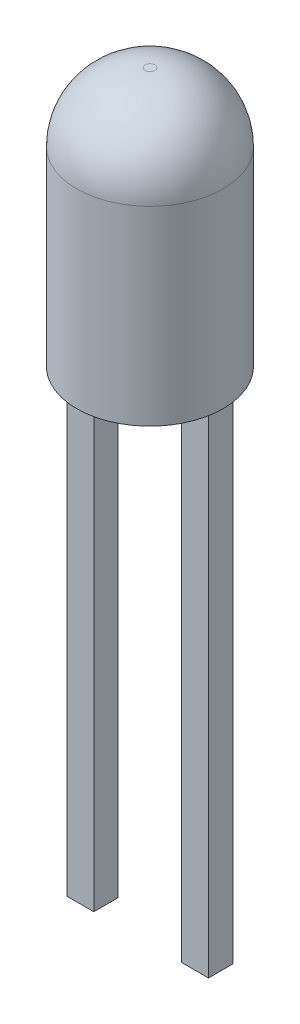
ISO-10303-21;
HEADER;
FILE_DESCRIPTION(('STEP AP214'),'2;1');
FILE_NAME('part.step','',(''),(''),'','','');
FILE_SCHEMA(('AUTOMOTIVE_DESIGN { 1 0 10303 214 1 1 1 1 }'));
ENDSEC;
DATA;
#1=APPLICATION_CONTEXT('core data for automotive mechanical design processes');
#2=APPLICATION_PROTOCOL_DEFINITION('international standard','automotive_design',2000,#1);
#3=PRODUCT_CONTEXT('',#1,'mechanical');
#4=PRODUCT('Part','Part','',(#3));
#5=PRODUCT_RELATED_PRODUCT_CATEGORY('part','',(#4));
#6=PRODUCT_DEFINITION_FORMATION('','',#4);
#7=PRODUCT_DEFINITION_CONTEXT('part definition',#1,'design');
#8=PRODUCT_DEFINITION('design','',#6,#7);
#9=PRODUCT_DEFINITION_SHAPE('','',#8);
#10=(LENGTH_UNIT() NAMED_UNIT(*) SI_UNIT(.MILLI.,.METRE.));
#11=(NAMED_UNIT(*) PLANE_ANGLE_UNIT() SI_UNIT($,.RADIAN.));
#12=(NAMED_UNIT(*) SI_UNIT($,.STERADIAN.) SOLID_ANGLE_UNIT());
#13=UNCERTAINTY_MEASURE_WITH_UNIT(LENGTH_MEASURE(1.E-05),#10,'distance_accuracy_value','');
#14=(GEOMETRIC_REPRESENTATION_CONTEXT(3) GLOBAL_UNCERTAINTY_ASSIGNED_CONTEXT((#13)) GLOBAL_UNIT_ASSIGNED_CONTEXT((#10,
#11,#12)) REPRESENTATION_CONTEXT('',''));
#15=CARTESIAN_POINT('',(0.,0.,0.));
#16=DIRECTION('',(0.,0.,1.));
#17=DIRECTION('',(1.,0.,0.));
#18=AXIS2_PLACEMENT_3D('',#15,#16,#17);
#19=CARTESIAN_POINT('',(0.899999999999999,-10.,0.25));
#20=DIRECTION('',(1.,0.,0.));
#21=DIRECTION('',(0.,0.,-1.));
#22=AXIS2_PLACEMENT_3D('',#19,#20,#21);
#23=PLANE('',#22);
#24=DIRECTION('',(0.,0.,-1.));
#25=VECTOR('',#24,1.);
#26=CARTESIAN_POINT('',(0.899999999999999,0.,0.25));
#27=LINE('',#26,#25);
#28=CARTESIAN_POINT('',(0.899999999999999,0.,0.25));
#29=VERTEX_POINT('',#28);
#30=CARTESIAN_POINT('',(0.899999999999999,0.,-0.25));
#31=VERTEX_POINT('',#30);
#32=EDGE_CURVE('E109',#29,#31,#27,.T.);
#33=ORIENTED_EDGE('',*,*,#32,.T.);
#34=DIRECTION('',(0.,1.,0.));
#35=VECTOR('',#34,1.);
#36=CARTESIAN_POINT('',(0.899999999999999,-10.,-0.25));
#37=LINE('',#36,#35);
#38=CARTESIAN_POINT('',(0.899999999999999,-10.,-0.25));
#39=VERTEX_POINT('',#38);
#40=EDGE_CURVE('E12',#39,#31,#37,.T.);
#41=ORIENTED_EDGE('',*,*,#40,.F.);
#42=DIRECTION('',(0.,0.,-1.));
#43=VECTOR('',#42,1.);
#44=CARTESIAN_POINT('',(0.899999999999999,-10.,0.25));
#45=LINE('',#44,#43);
#46=CARTESIAN_POINT('',(0.899999999999999,-10.,0.25));
#47=VERTEX_POINT('',#46);
#48=EDGE_CURVE('E97',#47,#39,#45,.T.);
#49=ORIENTED_EDGE('',*,*,#48,.F.);
#50=DIRECTION('',(0.,1.,0.));
#51=VECTOR('',#50,1.);
#52=CARTESIAN_POINT('',(0.899999999999999,-10.,0.25));
#53=LINE('',#52,#51);
#54=EDGE_CURVE('E105',#47,#29,#53,.T.);
#55=ORIENTED_EDGE('',*,*,#54,.T.);
#56=EDGE_LOOP('',(#33,#41,#49,#55));
#57=FACE_BOUND('',#56,.T.);
#58=ADVANCED_FACE('F46',(#57),#23,.F.);
#59=CARTESIAN_POINT('',(0.899999999999999,-10.,-0.25));
#60=DIRECTION('',(0.,0.,1.));
#61=DIRECTION('',(1.,0.,0.));
#62=AXIS2_PLACEMENT_3D('',#59,#60,#61);
#63=PLANE('',#62);
#64=DIRECTION('',(1.,0.,0.));
#65=VECTOR('',#64,1.);
#66=CARTESIAN_POINT('',(0.899999999999999,0.,-0.25));
#67=LINE('',#66,#65);
#68=CARTESIAN_POINT('',(1.45,0.,-0.25));
#69=VERTEX_POINT('',#68);
#70=EDGE_CURVE('E101',#31,#69,#67,.T.);
#71=ORIENTED_EDGE('',*,*,#70,.T.);
#72=DIRECTION('',(0.,1.,0.));
#73=VECTOR('',#72,1.);
#74=CARTESIAN_POINT('',(1.45,-10.,-0.25));
#75=LINE('',#74,#73);
#76=CARTESIAN_POINT('',(1.45,-10.,-0.25));
#77=VERTEX_POINT('',#76);
#78=EDGE_CURVE('E54',#77,#69,#75,.T.);
#79=ORIENTED_EDGE('',*,*,#78,.F.);
#80=DIRECTION('',(1.,0.,0.));
#81=VECTOR('',#80,1.);
#82=CARTESIAN_POINT('',(0.899999999999999,-10.,-0.25));
#83=LINE('',#82,#81);
#84=EDGE_CURVE('E92',#39,#77,#83,.T.);
#85=ORIENTED_EDGE('',*,*,#84,.F.);
#86=ORIENTED_EDGE('',*,*,#40,.T.);
#87=EDGE_LOOP('',(#71,#79,#85,#86));
#88=FACE_BOUND('',#87,.T.);
#89=ADVANCED_FACE('F100',(#88),#63,.F.);
#90=CARTESIAN_POINT('',(1.45,-10.,0.25));
#91=DIRECTION('',(-1.,0.,0.));
#92=DIRECTION('',(0.,0.,1.));
#93=AXIS2_PLACEMENT_3D('',#90,#91,#92);
#94=PLANE('',#93);
#95=DIRECTION('',(0.,0.,1.));
#96=VECTOR('',#95,1.);
#97=CARTESIAN_POINT('',(1.45,0.,0.25));
#98=LINE('',#97,#96);
#99=CARTESIAN_POINT('',(1.45,0.,0.25));
#100=VERTEX_POINT('',#99);
#101=EDGE_CURVE('E79',#69,#100,#98,.T.);
#102=ORIENTED_EDGE('',*,*,#101,.T.);
#103=DIRECTION('',(0.,1.,0.));
#104=VECTOR('',#103,1.);
#105=CARTESIAN_POINT('',(1.45,-10.,0.25));
#106=LINE('',#105,#104);
#107=CARTESIAN_POINT('',(1.45,-10.,0.25));
#108=VERTEX_POINT('',#107);
#109=EDGE_CURVE('E102',#108,#100,#106,.T.);
#110=ORIENTED_EDGE('',*,*,#109,.F.);
#111=DIRECTION('',(0.,0.,1.));
#112=VECTOR('',#111,1.);
#113=CARTESIAN_POINT('',(1.45,-10.,0.25));
#114=LINE('',#113,#112);
#115=EDGE_CURVE('E95',#77,#108,#114,.T.);
#116=ORIENTED_EDGE('',*,*,#115,.F.);
#117=ORIENTED_EDGE('',*,*,#78,.T.);
#118=EDGE_LOOP('',(#102,#110,#116,#117));
#119=FACE_BOUND('',#118,.T.);
#120=ADVANCED_FACE('F103',(#119),#94,.F.);
#121=CARTESIAN_POINT('',(0.899999999999999,-10.,0.25));
#122=DIRECTION('',(0.,0.,-1.));
#123=DIRECTION('',(-1.,0.,0.));
#124=AXIS2_PLACEMENT_3D('',#121,#122,#123);
#125=PLANE('',#124);
#126=DIRECTION('',(-1.,0.,0.));
#127=VECTOR('',#126,1.);
#128=CARTESIAN_POINT('',(0.899999999999999,0.,0.25));
#129=LINE('',#128,#127);
#130=EDGE_CURVE('E85',#100,#29,#129,.T.);
#131=ORIENTED_EDGE('',*,*,#130,.T.);
#132=ORIENTED_EDGE('',*,*,#54,.F.);
#133=DIRECTION('',(-1.,0.,0.));
#134=VECTOR('',#133,1.);
#135=CARTESIAN_POINT('',(0.899999999999999,-10.,0.25));
#136=LINE('',#135,#134);
#137=EDGE_CURVE('E62',#108,#47,#136,.T.);
#138=ORIENTED_EDGE('',*,*,#137,.F.);
#139=ORIENTED_EDGE('',*,*,#109,.T.);
#140=EDGE_LOOP('',(#131,#132,#138,#139));
#141=FACE_BOUND('',#140,.T.);
#142=ADVANCED_FACE('F116',(#141),#125,.F.);
#143=CARTESIAN_POINT('',(0.,-10.,0.));
#144=DIRECTION('',(0.,-1.,0.));
#145=DIRECTION('',(0.,0.,-1.));
#146=AXIS2_PLACEMENT_3D('',#143,#144,#145);
#147=PLANE('',#146);
#148=ORIENTED_EDGE('',*,*,#48,.T.);
#149=ORIENTED_EDGE('',*,*,#84,.T.);
#150=ORIENTED_EDGE('',*,*,#115,.T.);
#151=ORIENTED_EDGE('',*,*,#137,.T.);
#152=EDGE_LOOP('',(#148,#149,#150,#151));
#153=FACE_BOUND('',#152,.T.);
#154=ADVANCED_FACE('F93',(#153),#147,.T.);
#155=CARTESIAN_POINT('',(0.,0.,0.));
#156=DIRECTION('',(0.,-1.,0.));
#157=DIRECTION('',(0.,0.,-1.));
#158=AXIS2_PLACEMENT_3D('',#155,#156,#157);
#159=PLANE('',#158);
#160=ORIENTED_EDGE('',*,*,#32,.F.);
#161=ORIENTED_EDGE('',*,*,#130,.F.);
#162=ORIENTED_EDGE('',*,*,#101,.F.);
#163=ORIENTED_EDGE('',*,*,#70,.F.);
#164=EDGE_LOOP('',(#160,#161,#162,#163));
#165=FACE_BOUND('',#164,.T.);
#166=ADVANCED_FACE('F119',(#165),#159,.F.);
#167=CLOSED_SHELL('',(#58,#89,#120,#142,#154,#166));
#168=MANIFOLD_SOLID_BREP('B2',#167);
#169=CARTESIAN_POINT('',(-1.45,-10.,0.25));
#170=DIRECTION('',(1.,0.,0.));
#171=DIRECTION('',(0.,0.,-1.));
#172=AXIS2_PLACEMENT_3D('',#169,#170,#171);
#173=PLANE('',#172);
#174=DIRECTION('',(0.,0.,-1.));
#175=VECTOR('',#174,1.);
#176=CARTESIAN_POINT('',(-1.45,0.,0.25));
#177=LINE('',#176,#175);
#178=CARTESIAN_POINT('',(-1.45,0.,0.25));
#179=VERTEX_POINT('',#178);
#180=CARTESIAN_POINT('',(-1.45,0.,-0.25));
#181=VERTEX_POINT('',#180);
#182=EDGE_CURVE('E243',#179,#181,#177,.T.);
#183=ORIENTED_EDGE('',*,*,#182,.T.);
#184=DIRECTION('',(0.,1.,0.));
#185=VECTOR('',#184,1.);
#186=CARTESIAN_POINT('',(-1.45,-10.,-0.25));
#187=LINE('',#186,#185);
#188=CARTESIAN_POINT('',(-1.45,-10.,-0.25));
#189=VERTEX_POINT('',#188);
#190=EDGE_CURVE('E44',#189,#181,#187,.T.);
#191=ORIENTED_EDGE('',*,*,#190,.F.);
#192=DIRECTION('',(0.,0.,-1.));
#193=VECTOR('',#192,1.);
#194=CARTESIAN_POINT('',(-1.45,-10.,0.25));
#195=LINE('',#194,#193);
#196=CARTESIAN_POINT('',(-1.45,-10.,0.25));
#197=VERTEX_POINT('',#196);
#198=EDGE_CURVE('E231',#197,#189,#195,.T.);
#199=ORIENTED_EDGE('',*,*,#198,.F.);
#200=DIRECTION('',(0.,1.,0.));
#201=VECTOR('',#200,1.);
#202=CARTESIAN_POINT('',(-1.45,-10.,0.25));
#203=LINE('',#202,#201);
#204=EDGE_CURVE('E239',#197,#179,#203,.T.);
#205=ORIENTED_EDGE('',*,*,#204,.T.);
#206=EDGE_LOOP('',(#183,#191,#199,#205));
#207=FACE_BOUND('',#206,.T.);
#208=ADVANCED_FACE('F180',(#207),#173,.F.);
#209=CARTESIAN_POINT('',(-1.45,-10.,-0.25));
#210=DIRECTION('',(0.,0.,1.));
#211=DIRECTION('',(1.,0.,0.));
#212=AXIS2_PLACEMENT_3D('',#209,#210,#211);
#213=PLANE('',#212);
#214=DIRECTION('',(1.,0.,0.));
#215=VECTOR('',#214,1.);
#216=CARTESIAN_POINT('',(-1.45,0.,-0.25));
#217=LINE('',#216,#215);
#218=CARTESIAN_POINT('',(-0.9,0.,-0.25));
#219=VERTEX_POINT('',#218);
#220=EDGE_CURVE('E235',#181,#219,#217,.T.);
#221=ORIENTED_EDGE('',*,*,#220,.T.);
#222=DIRECTION('',(0.,1.,0.));
#223=VECTOR('',#222,1.);
#224=CARTESIAN_POINT('',(-0.9,-10.,-0.25));
#225=LINE('',#224,#223);
#226=CARTESIAN_POINT('',(-0.9,-10.,-0.25));
#227=VERTEX_POINT('',#226);
#228=EDGE_CURVE('E188',#227,#219,#225,.T.);
#229=ORIENTED_EDGE('',*,*,#228,.F.);
#230=DIRECTION('',(1.,0.,0.));
#231=VECTOR('',#230,1.);
#232=CARTESIAN_POINT('',(-1.45,-10.,-0.25));
#233=LINE('',#232,#231);
#234=EDGE_CURVE('E226',#189,#227,#233,.T.);
#235=ORIENTED_EDGE('',*,*,#234,.F.);
#236=ORIENTED_EDGE('',*,*,#190,.T.);
#237=EDGE_LOOP('',(#221,#229,#235,#236));
#238=FACE_BOUND('',#237,.T.);
#239=ADVANCED_FACE('F234',(#238),#213,.F.);
#240=CARTESIAN_POINT('',(-0.9,-10.,0.25));
#241=DIRECTION('',(-1.,0.,0.));
#242=DIRECTION('',(0.,0.,1.));
#243=AXIS2_PLACEMENT_3D('',#240,#241,#242);
#244=PLANE('',#243);
#245=DIRECTION('',(0.,0.,1.));
#246=VECTOR('',#245,1.);
#247=CARTESIAN_POINT('',(-0.9,0.,0.25));
#248=LINE('',#247,#246);
#249=CARTESIAN_POINT('',(-0.9,0.,0.25));
#250=VERTEX_POINT('',#249);
#251=EDGE_CURVE('E213',#219,#250,#248,.T.);
#252=ORIENTED_EDGE('',*,*,#251,.T.);
#253=DIRECTION('',(0.,1.,0.));
#254=VECTOR('',#253,1.);
#255=CARTESIAN_POINT('',(-0.9,-10.,0.25));
#256=LINE('',#255,#254);
#257=CARTESIAN_POINT('',(-0.9,-10.,0.25));
#258=VERTEX_POINT('',#257);
#259=EDGE_CURVE('E236',#258,#250,#256,.T.);
#260=ORIENTED_EDGE('',*,*,#259,.F.);
#261=DIRECTION('',(0.,0.,1.));
#262=VECTOR('',#261,1.);
#263=CARTESIAN_POINT('',(-0.9,-10.,0.25));
#264=LINE('',#263,#262);
#265=EDGE_CURVE('E229',#227,#258,#264,.T.);
#266=ORIENTED_EDGE('',*,*,#265,.F.);
#267=ORIENTED_EDGE('',*,*,#228,.T.);
#268=EDGE_LOOP('',(#252,#260,#266,#267));
#269=FACE_BOUND('',#268,.T.);
#270=ADVANCED_FACE('F237',(#269),#244,.F.);
#271=CARTESIAN_POINT('',(-1.45,-10.,0.25));
#272=DIRECTION('',(0.,0.,-1.));
#273=DIRECTION('',(-1.,0.,0.));
#274=AXIS2_PLACEMENT_3D('',#271,#272,#273);
#275=PLANE('',#274);
#276=DIRECTION('',(-1.,0.,0.));
#277=VECTOR('',#276,1.);
#278=CARTESIAN_POINT('',(-1.45,0.,0.25));
#279=LINE('',#278,#277);
#280=EDGE_CURVE('E219',#250,#179,#279,.T.);
#281=ORIENTED_EDGE('',*,*,#280,.T.);
#282=ORIENTED_EDGE('',*,*,#204,.F.);
#283=DIRECTION('',(-1.,0.,0.));
#284=VECTOR('',#283,1.);
#285=CARTESIAN_POINT('',(-1.45,-10.,0.25));
#286=LINE('',#285,#284);
#287=EDGE_CURVE('E196',#258,#197,#286,.T.);
#288=ORIENTED_EDGE('',*,*,#287,.F.);
#289=ORIENTED_EDGE('',*,*,#259,.T.);
#290=EDGE_LOOP('',(#281,#282,#288,#289));
#291=FACE_BOUND('',#290,.T.);
#292=ADVANCED_FACE('F250',(#291),#275,.F.);
#293=CARTESIAN_POINT('',(0.,-10.,0.));
#294=DIRECTION('',(0.,-1.,0.));
#295=DIRECTION('',(0.,0.,-1.));
#296=AXIS2_PLACEMENT_3D('',#293,#294,#295);
#297=PLANE('',#296);
#298=ORIENTED_EDGE('',*,*,#198,.T.);
#299=ORIENTED_EDGE('',*,*,#234,.T.);
#300=ORIENTED_EDGE('',*,*,#265,.T.);
#301=ORIENTED_EDGE('',*,*,#287,.T.);
#302=EDGE_LOOP('',(#298,#299,#300,#301));
#303=FACE_BOUND('',#302,.T.);
#304=ADVANCED_FACE('F227',(#303),#297,.T.);
#305=CARTESIAN_POINT('',(0.,0.,0.));
#306=DIRECTION('',(0.,-1.,0.));
#307=DIRECTION('',(0.,0.,-1.));
#308=AXIS2_PLACEMENT_3D('',#305,#306,#307);
#309=PLANE('',#308);
#310=ORIENTED_EDGE('',*,*,#182,.F.);
#311=ORIENTED_EDGE('',*,*,#280,.F.);
#312=ORIENTED_EDGE('',*,*,#251,.F.);
#313=ORIENTED_EDGE('',*,*,#220,.F.);
#314=EDGE_LOOP('',(#310,#311,#312,#313));
#315=FACE_BOUND('',#314,.T.);
#316=ADVANCED_FACE('F253',(#315),#309,.F.);
#317=CLOSED_SHELL('',(#208,#239,#270,#292,#304,#316));
#318=MANIFOLD_SOLID_BREP('B6',#317);
#319=CARTESIAN_POINT('',(1.45,0.,-0.25));
#320=DIRECTION('',(1.,0.,0.));
#321=DIRECTION('',(0.,1.,0.));
#322=AXIS2_PLACEMENT_3D('',#319,#320,#321);
#323=PLANE('',#322);
#324=DIRECTION('',(0.,0.,1.));
#325=VECTOR('',#324,1.);
#326=CARTESIAN_POINT('',(1.45,2.6,-0.25));
#327=LINE('',#326,#325);
#328=CARTESIAN_POINT('',(1.45,2.6,-0.25));
#329=VERTEX_POINT('',#328);
#330=CARTESIAN_POINT('',(1.45,2.6,0.25));
#331=VERTEX_POINT('',#330);
#332=EDGE_CURVE('E317',#329,#331,#327,.T.);
#333=ORIENTED_EDGE('',*,*,#332,.T.);
#334=DIRECTION('',(0.,1.,0.));
#335=VECTOR('',#334,1.);
#336=CARTESIAN_POINT('',(1.45,0.,0.25));
#337=LINE('',#336,#335);
#338=CARTESIAN_POINT('',(1.45,0.,0.25));
#339=VERTEX_POINT('',#338);
#340=EDGE_CURVE('E366',#339,#331,#337,.T.);
#341=ORIENTED_EDGE('',*,*,#340,.F.);
#342=DIRECTION('',(0.,0.,1.));
#343=VECTOR('',#342,1.);
#344=CARTESIAN_POINT('',(1.45,0.,-0.25));
#345=LINE('',#344,#343);
#346=CARTESIAN_POINT('',(1.45,0.,-0.25));
#347=VERTEX_POINT('',#346);
#348=EDGE_CURVE('E178',#347,#339,#345,.T.);
#349=ORIENTED_EDGE('',*,*,#348,.F.);
#350=DIRECTION('',(0.,1.,0.));
#351=VECTOR('',#350,1.);
#352=CARTESIAN_POINT('',(1.45,0.,-0.25));
#353=LINE('',#352,#351);
#354=EDGE_CURVE('E367',#347,#329,#353,.T.);
#355=ORIENTED_EDGE('',*,*,#354,.T.);
#356=EDGE_LOOP('',(#333,#341,#349,#355));
#357=FACE_BOUND('',#356,.T.);
#358=ADVANCED_FACE('F314',(#357),#323,.T.);
#359=CARTESIAN_POINT('',(0.899999999999999,0.,-0.25));
#360=DIRECTION('',(0.,-1.,0.));
#361=DIRECTION('',(1.,0.,0.));
#362=AXIS2_PLACEMENT_3D('',#359,#360,#361);
#363=PLANE('',#362);
#364=ORIENTED_EDGE('',*,*,#348,.T.);
#365=DIRECTION('',(1.,0.,0.));
#366=VECTOR('',#365,1.);
#367=CARTESIAN_POINT('',(0.899999999999999,0.,0.25));
#368=LINE('',#367,#366);
#369=CARTESIAN_POINT('',(0.899999999999999,0.,0.25));
#370=VERTEX_POINT('',#369);
#371=EDGE_CURVE('E384',#370,#339,#368,.T.);
#372=ORIENTED_EDGE('',*,*,#371,.F.);
#373=DIRECTION('',(0.,0.,1.));
#374=VECTOR('',#373,1.);
#375=CARTESIAN_POINT('',(0.899999999999999,0.,-0.25));
#376=LINE('',#375,#374);
#377=CARTESIAN_POINT('',(0.899999999999999,0.,-0.25));
#378=VERTEX_POINT('',#377);
#379=EDGE_CURVE('E322',#378,#370,#376,.T.);
#380=ORIENTED_EDGE('',*,*,#379,.F.);
#381=DIRECTION('',(1.,0.,0.));
#382=VECTOR('',#381,1.);
#383=CARTESIAN_POINT('',(0.899999999999999,0.,-0.25));
#384=LINE('',#383,#382);
#385=EDGE_CURVE('E372',#378,#347,#384,.T.);
#386=ORIENTED_EDGE('',*,*,#385,.T.);
#387=EDGE_LOOP('',(#364,#372,#380,#386));
#388=FACE_BOUND('',#387,.T.);
#389=ADVANCED_FACE('F424',(#388),#363,.T.);
#390=CARTESIAN_POINT('',(0.899999999999999,0.6,-0.25));
#391=DIRECTION('',(-1.,0.,0.));
#392=DIRECTION('',(0.,0.,1.));
#393=AXIS2_PLACEMENT_3D('',#390,#391,#392);
#394=PLANE('',#393);
#395=ORIENTED_EDGE('',*,*,#379,.T.);
#396=DIRECTION('',(0.,-1.,0.));
#397=VECTOR('',#396,1.);
#398=CARTESIAN_POINT('',(0.899999999999999,0.6,0.25));
#399=LINE('',#398,#397);
#400=CARTESIAN_POINT('',(0.899999999999999,0.6,0.25));
#401=VERTEX_POINT('',#400);
#402=EDGE_CURVE('E391',#401,#370,#399,.T.);
#403=ORIENTED_EDGE('',*,*,#402,.F.);
#404=DIRECTION('',(0.,0.,1.));
#405=VECTOR('',#404,1.);
#406=CARTESIAN_POINT('',(0.899999999999999,0.6,-0.25));
#407=LINE('',#406,#405);
#408=CARTESIAN_POINT('',(0.899999999999999,0.6,-0.25));
#409=VERTEX_POINT('',#408);
#410=EDGE_CURVE('E407',#409,#401,#407,.T.);
#411=ORIENTED_EDGE('',*,*,#410,.F.);
#412=DIRECTION('',(0.,-1.,0.));
#413=VECTOR('',#412,1.);
#414=CARTESIAN_POINT('',(0.899999999999999,0.6,-0.25));
#415=LINE('',#414,#413);
#416=EDGE_CURVE('E403',#409,#378,#415,.T.);
#417=ORIENTED_EDGE('',*,*,#416,.T.);
#418=EDGE_LOOP('',(#395,#403,#411,#417));
#419=FACE_BOUND('',#418,.T.);
#420=ADVANCED_FACE('F420',(#419),#394,.T.);
#421=CARTESIAN_POINT('',(0.496677265615149,0.6,-0.25));
#422=DIRECTION('',(0.,-1.,0.));
#423=DIRECTION('',(0.,0.,-1.));
#424=AXIS2_PLACEMENT_3D('',#421,#422,#423);
#425=PLANE('',#424);
#426=ORIENTED_EDGE('',*,*,#410,.T.);
#427=DIRECTION('',(1.,0.,0.));
#428=VECTOR('',#427,1.);
#429=CARTESIAN_POINT('',(0.496677265615149,0.6,0.25));
#430=LINE('',#429,#428);
#431=CARTESIAN_POINT('',(0.496677265615149,0.6,0.25));
#432=VERTEX_POINT('',#431);
#433=EDGE_CURVE('E388',#432,#401,#430,.T.);
#434=ORIENTED_EDGE('',*,*,#433,.F.);
#435=DIRECTION('',(0.,0.,1.));
#436=VECTOR('',#435,1.);
#437=CARTESIAN_POINT('',(0.496677265615149,0.6,-0.25));
#438=LINE('',#437,#436);
#439=CARTESIAN_POINT('',(0.496677265615149,0.6,-0.25));
#440=VERTEX_POINT('',#439);
#441=EDGE_CURVE('E409',#440,#432,#438,.T.);
#442=ORIENTED_EDGE('',*,*,#441,.F.);
#443=DIRECTION('',(1.,0.,0.));
#444=VECTOR('',#443,1.);
#445=CARTESIAN_POINT('',(0.496677265615149,0.6,-0.25));
#446=LINE('',#445,#444);
#447=EDGE_CURVE('E400',#440,#409,#446,.T.);
#448=ORIENTED_EDGE('',*,*,#447,.T.);
#449=EDGE_LOOP('',(#426,#434,#442,#448));
#450=FACE_BOUND('',#449,.T.);
#451=ADVANCED_FACE('F417',(#450),#425,.T.);
#452=CARTESIAN_POINT('',(-0.872452828416084,2.6,-0.25));
#453=DIRECTION('',(-0.825170902439274,-0.56488315762426,0.));
#454=DIRECTION('',(0.56488315762426,-0.825170902439274,0.));
#455=AXIS2_PLACEMENT_3D('',#452,#453,#454);
#456=PLANE('',#455);
#457=ORIENTED_EDGE('',*,*,#441,.T.);
#458=DIRECTION('',(0.56488315762426,-0.825170902439274,0.));
#459=VECTOR('',#458,1.);
#460=CARTESIAN_POINT('',(-0.872452828416084,2.6,0.25));
#461=LINE('',#460,#459);
#462=CARTESIAN_POINT('',(-0.872452828416084,2.6,0.25));
#463=VERTEX_POINT('',#462);
#464=EDGE_CURVE('E379',#463,#432,#461,.T.);
#465=ORIENTED_EDGE('',*,*,#464,.F.);
#466=DIRECTION('',(0.,0.,1.));
#467=VECTOR('',#466,1.);
#468=CARTESIAN_POINT('',(-0.872452828416084,2.6,-0.25));
#469=LINE('',#468,#467);
#470=CARTESIAN_POINT('',(-0.872452828416084,2.6,-0.25));
#471=VERTEX_POINT('',#470);
#472=EDGE_CURVE('E371',#471,#463,#469,.T.);
#473=ORIENTED_EDGE('',*,*,#472,.F.);
#474=DIRECTION('',(0.56488315762426,-0.825170902439274,0.));
#475=VECTOR('',#474,1.);
#476=CARTESIAN_POINT('',(-0.872452828416084,2.6,-0.25));
#477=LINE('',#476,#475);
#478=EDGE_CURVE('E397',#471,#440,#477,.T.);
#479=ORIENTED_EDGE('',*,*,#478,.T.);
#480=EDGE_LOOP('',(#457,#465,#473,#479));
#481=FACE_BOUND('',#480,.T.);
#482=ADVANCED_FACE('F411',(#481),#456,.T.);
#483=CARTESIAN_POINT('',(1.45,2.6,-0.25));
#484=DIRECTION('',(0.,1.,0.));
#485=DIRECTION('',(-1.,0.,0.));
#486=AXIS2_PLACEMENT_3D('',#483,#484,#485);
#487=PLANE('',#486);
#488=ORIENTED_EDGE('',*,*,#472,.T.);
#489=DIRECTION('',(-1.,0.,0.));
#490=VECTOR('',#489,1.);
#491=CARTESIAN_POINT('',(1.45,2.6,0.25));
#492=LINE('',#491,#490);
#493=EDGE_CURVE('E374',#331,#463,#492,.T.);
#494=ORIENTED_EDGE('',*,*,#493,.F.);
#495=ORIENTED_EDGE('',*,*,#332,.F.);
#496=DIRECTION('',(-1.,0.,0.));
#497=VECTOR('',#496,1.);
#498=CARTESIAN_POINT('',(1.45,2.6,-0.25));
#499=LINE('',#498,#497);
#500=EDGE_CURVE('E395',#329,#471,#499,.T.);
#501=ORIENTED_EDGE('',*,*,#500,.T.);
#502=EDGE_LOOP('',(#488,#494,#495,#501));
#503=FACE_BOUND('',#502,.T.);
#504=ADVANCED_FACE('F375',(#503),#487,.T.);
#505=CARTESIAN_POINT('',(0.,0.,-0.25));
#506=DIRECTION('',(0.,0.,1.));
#507=DIRECTION('',(1.,0.,0.));
#508=AXIS2_PLACEMENT_3D('',#505,#506,#507);
#509=PLANE('',#508);
#510=ORIENTED_EDGE('',*,*,#354,.F.);
#511=ORIENTED_EDGE('',*,*,#385,.F.);
#512=ORIENTED_EDGE('',*,*,#416,.F.);
#513=ORIENTED_EDGE('',*,*,#447,.F.);
#514=ORIENTED_EDGE('',*,*,#478,.F.);
#515=ORIENTED_EDGE('',*,*,#500,.F.);
#516=EDGE_LOOP('',(#510,#511,#512,#513,#514,#515));
#517=FACE_BOUND('',#516,.T.);
#518=ADVANCED_FACE('F423',(#517),#509,.F.);
#519=CARTESIAN_POINT('',(0.,0.,0.25));
#520=DIRECTION('',(0.,0.,1.));
#521=DIRECTION('',(1.,0.,0.));
#522=AXIS2_PLACEMENT_3D('',#519,#520,#521);
#523=PLANE('',#522);
#524=ORIENTED_EDGE('',*,*,#340,.T.);
#525=ORIENTED_EDGE('',*,*,#493,.T.);
#526=ORIENTED_EDGE('',*,*,#464,.T.);
#527=ORIENTED_EDGE('',*,*,#433,.T.);
#528=ORIENTED_EDGE('',*,*,#402,.T.);
#529=ORIENTED_EDGE('',*,*,#371,.T.);
#530=EDGE_LOOP('',(#524,#525,#526,#527,#528,#529));
#531=FACE_BOUND('',#530,.T.);
#532=ADVANCED_FACE('F382',(#531),#523,.T.);
#533=CLOSED_SHELL('',(#358,#389,#420,#451,#482,#504,#518,#532));
#534=MANIFOLD_SOLID_BREP('B38',#533);
#535=CARTESIAN_POINT('',(-0.9,0.,-0.25));
#536=DIRECTION('',(1.,0.,0.));
#537=DIRECTION('',(0.,0.,-1.));
#538=AXIS2_PLACEMENT_3D('',#535,#536,#537);
#539=PLANE('',#538);
#540=DIRECTION('',(0.,0.,1.));
#541=VECTOR('',#540,1.);
#542=CARTESIAN_POINT('',(-0.9,0.6,-0.25));
#543=LINE('',#542,#541);
#544=CARTESIAN_POINT('',(-0.9,0.6,-0.25));
#545=VERTEX_POINT('',#544);
#546=CARTESIAN_POINT('',(-0.9,0.6,0.25));
#547=VERTEX_POINT('',#546);
#548=EDGE_CURVE('E500',#545,#547,#543,.T.);
#549=ORIENTED_EDGE('',*,*,#548,.T.);
#550=DIRECTION('',(0.,1.,0.));
#551=VECTOR('',#550,1.);
#552=CARTESIAN_POINT('',(-0.9,0.,0.25));
#553=LINE('',#552,#551);
#554=CARTESIAN_POINT('',(-0.9,0.,0.25));
#555=VERTEX_POINT('',#554);
#556=EDGE_CURVE('E555',#555,#547,#553,.T.);
#557=ORIENTED_EDGE('',*,*,#556,.F.);
#558=DIRECTION('',(0.,0.,1.));
#559=VECTOR('',#558,1.);
#560=CARTESIAN_POINT('',(-0.9,0.,-0.25));
#561=LINE('',#560,#559);
#562=CARTESIAN_POINT('',(-0.9,0.,-0.25));
#563=VERTEX_POINT('',#562);
#564=EDGE_CURVE('E312',#563,#555,#561,.T.);
#565=ORIENTED_EDGE('',*,*,#564,.F.);
#566=DIRECTION('',(0.,1.,0.));
#567=VECTOR('',#566,1.);
#568=CARTESIAN_POINT('',(-0.9,0.,-0.25));
#569=LINE('',#568,#567);
#570=EDGE_CURVE('E556',#563,#545,#569,.T.);
#571=ORIENTED_EDGE('',*,*,#570,.T.);
#572=EDGE_LOOP('',(#549,#557,#565,#571));
#573=FACE_BOUND('',#572,.T.);
#574=ADVANCED_FACE('F497',(#573),#539,.T.);
#575=CARTESIAN_POINT('',(-1.45,0.,-0.25));
#576=DIRECTION('',(0.,-1.,0.));
#577=DIRECTION('',(1.,0.,0.));
#578=AXIS2_PLACEMENT_3D('',#575,#576,#577);
#579=PLANE('',#578);
#580=ORIENTED_EDGE('',*,*,#564,.T.);
#581=DIRECTION('',(1.,0.,0.));
#582=VECTOR('',#581,1.);
#583=CARTESIAN_POINT('',(-1.45,0.,0.25));
#584=LINE('',#583,#582);
#585=CARTESIAN_POINT('',(-1.45,0.,0.25));
#586=VERTEX_POINT('',#585);
#587=EDGE_CURVE('E573',#586,#555,#584,.T.);
#588=ORIENTED_EDGE('',*,*,#587,.F.);
#589=DIRECTION('',(0.,0.,1.));
#590=VECTOR('',#589,1.);
#591=CARTESIAN_POINT('',(-1.45,0.,-0.25));
#592=LINE('',#591,#590);
#593=CARTESIAN_POINT('',(-1.45,0.,-0.25));
#594=VERTEX_POINT('',#593);
#595=EDGE_CURVE('E505',#594,#586,#592,.T.);
#596=ORIENTED_EDGE('',*,*,#595,.F.);
#597=DIRECTION('',(1.,0.,0.));
#598=VECTOR('',#597,1.);
#599=CARTESIAN_POINT('',(-1.45,0.,-0.25));
#600=LINE('',#599,#598);
#601=EDGE_CURVE('E561',#594,#563,#600,.T.);
#602=ORIENTED_EDGE('',*,*,#601,.T.);
#603=EDGE_LOOP('',(#580,#588,#596,#602));
#604=FACE_BOUND('',#603,.T.);
#605=ADVANCED_FACE('F625',(#604),#579,.T.);
#606=CARTESIAN_POINT('',(-1.45,2.6,-0.25));
#607=DIRECTION('',(-1.,0.,0.));
#608=DIRECTION('',(0.,0.,1.));
#609=AXIS2_PLACEMENT_3D('',#606,#607,#608);
#610=PLANE('',#609);
#611=ORIENTED_EDGE('',*,*,#595,.T.);
#612=DIRECTION('',(0.,-1.,0.));
#613=VECTOR('',#612,1.);
#614=CARTESIAN_POINT('',(-1.45,2.6,0.25));
#615=LINE('',#614,#613);
#616=CARTESIAN_POINT('',(-1.45,2.6,0.25));
#617=VERTEX_POINT('',#616);
#618=EDGE_CURVE('E583',#617,#586,#615,.T.);
#619=ORIENTED_EDGE('',*,*,#618,.F.);
#620=DIRECTION('',(0.,0.,1.));
#621=VECTOR('',#620,1.);
#622=CARTESIAN_POINT('',(-1.45,2.6,-0.25));
#623=LINE('',#622,#621);
#624=CARTESIAN_POINT('',(-1.45,2.6,-0.25));
#625=VERTEX_POINT('',#624);
#626=EDGE_CURVE('E602',#625,#617,#623,.T.);
#627=ORIENTED_EDGE('',*,*,#626,.F.);
#628=DIRECTION('',(0.,-1.,0.));
#629=VECTOR('',#628,1.);
#630=CARTESIAN_POINT('',(-1.45,2.6,-0.25));
#631=LINE('',#630,#629);
#632=EDGE_CURVE('E598',#625,#594,#631,.T.);
#633=ORIENTED_EDGE('',*,*,#632,.T.);
#634=EDGE_LOOP('',(#611,#619,#627,#633));
#635=FACE_BOUND('',#634,.T.);
#636=ADVANCED_FACE('F623',(#635),#610,.T.);
#637=CARTESIAN_POINT('',(-1.22535509609001,2.6,-0.25));
#638=DIRECTION('',(0.,1.,0.));
#639=DIRECTION('',(0.,0.,1.));
#640=AXIS2_PLACEMENT_3D('',#637,#638,#639);
#641=PLANE('',#640);
#642=ORIENTED_EDGE('',*,*,#626,.T.);
#643=DIRECTION('',(-1.,0.,0.));
#644=VECTOR('',#643,1.);
#645=CARTESIAN_POINT('',(-1.22535509609001,2.6,0.25));
#646=LINE('',#645,#644);
#647=CARTESIAN_POINT('',(-1.22535509609001,2.6,0.25));
#648=VERTEX_POINT('',#647);
#649=EDGE_CURVE('E580',#648,#617,#646,.T.);
#650=ORIENTED_EDGE('',*,*,#649,.F.);
#651=DIRECTION('',(0.,0.,1.));
#652=VECTOR('',#651,1.);
#653=CARTESIAN_POINT('',(-1.22535509609001,2.6,-0.25));
#654=LINE('',#653,#652);
#655=CARTESIAN_POINT('',(-1.22535509609001,2.6,-0.25));
#656=VERTEX_POINT('',#655);
#657=EDGE_CURVE('E604',#656,#648,#654,.T.);
#658=ORIENTED_EDGE('',*,*,#657,.F.);
#659=DIRECTION('',(-1.,0.,0.));
#660=VECTOR('',#659,1.);
#661=CARTESIAN_POINT('',(-1.22535509609001,2.6,-0.25));
#662=LINE('',#661,#660);
#663=EDGE_CURVE('E595',#656,#625,#662,.T.);
#664=ORIENTED_EDGE('',*,*,#663,.T.);
#665=EDGE_LOOP('',(#642,#650,#658,#664));
#666=FACE_BOUND('',#665,.T.);
#667=ADVANCED_FACE('F617',(#666),#641,.T.);
#668=CARTESIAN_POINT('',(-0.62411419560851,0.825037810223286,-0.25));
#669=DIRECTION('',(0.947137436510032,0.320828110303952,0.));
#670=DIRECTION('',(-0.320828110303952,0.947137436510032,0.));
#671=AXIS2_PLACEMENT_3D('',#668,#669,#670);
#672=PLANE('',#671);
#673=ORIENTED_EDGE('',*,*,#657,.T.);
#674=DIRECTION('',(-0.320828110303952,0.947137436510032,0.));
#675=VECTOR('',#674,1.);
#676=CARTESIAN_POINT('',(-0.62411419560851,0.825037810223286,0.25));
#677=LINE('',#676,#675);
#678=CARTESIAN_POINT('',(-0.62411419560851,0.825037810223286,0.25));
#679=VERTEX_POINT('',#678);
#680=EDGE_CURVE('E577',#679,#648,#677,.T.);
#681=ORIENTED_EDGE('',*,*,#680,.F.);
#682=DIRECTION('',(0.,0.,1.));
#683=VECTOR('',#682,1.);
#684=CARTESIAN_POINT('',(-0.62411419560851,0.825037810223286,-0.25));
#685=LINE('',#684,#683);
#686=CARTESIAN_POINT('',(-0.62411419560851,0.825037810223286,-0.25));
#687=VERTEX_POINT('',#686);
#688=EDGE_CURVE('E606',#687,#679,#685,.T.);
#689=ORIENTED_EDGE('',*,*,#688,.F.);
#690=DIRECTION('',(-0.320828110303952,0.947137436510032,0.));
#691=VECTOR('',#690,1.);
#692=CARTESIAN_POINT('',(-0.62411419560851,0.825037810223286,-0.25));
#693=LINE('',#692,#691);
#694=EDGE_CURVE('E592',#687,#656,#693,.T.);
#695=ORIENTED_EDGE('',*,*,#694,.T.);
#696=EDGE_LOOP('',(#673,#681,#689,#695));
#697=FACE_BOUND('',#696,.T.);
#698=ADVANCED_FACE('F614',(#697),#672,.T.);
#699=CARTESIAN_POINT('',(-0.62411419560851,0.6,-0.25));
#700=DIRECTION('',(1.,0.,0.));
#701=DIRECTION('',(0.,0.,-1.));
#702=AXIS2_PLACEMENT_3D('',#699,#700,#701);
#703=PLANE('',#702);
#704=ORIENTED_EDGE('',*,*,#688,.T.);
#705=DIRECTION('',(0.,1.,0.));
#706=VECTOR('',#705,1.);
#707=CARTESIAN_POINT('',(-0.62411419560851,0.6,0.25));
#708=LINE('',#707,#706);
#709=CARTESIAN_POINT('',(-0.62411419560851,0.6,0.25));
#710=VERTEX_POINT('',#709);
#711=EDGE_CURVE('E568',#710,#679,#708,.T.);
#712=ORIENTED_EDGE('',*,*,#711,.F.);
#713=DIRECTION('',(0.,0.,1.));
#714=VECTOR('',#713,1.);
#715=CARTESIAN_POINT('',(-0.62411419560851,0.6,-0.25));
#716=LINE('',#715,#714);
#717=CARTESIAN_POINT('',(-0.62411419560851,0.6,-0.25));
#718=VERTEX_POINT('',#717);
#719=EDGE_CURVE('E560',#718,#710,#716,.T.);
#720=ORIENTED_EDGE('',*,*,#719,.F.);
#721=DIRECTION('',(0.,1.,0.));
#722=VECTOR('',#721,1.);
#723=CARTESIAN_POINT('',(-0.62411419560851,0.6,-0.25));
#724=LINE('',#723,#722);
#725=EDGE_CURVE('E589',#718,#687,#724,.T.);
#726=ORIENTED_EDGE('',*,*,#725,.T.);
#727=EDGE_LOOP('',(#704,#712,#720,#726));
#728=FACE_BOUND('',#727,.T.);
#729=ADVANCED_FACE('F608',(#728),#703,.T.);
#730=CARTESIAN_POINT('',(-0.9,0.6,-0.25));
#731=DIRECTION('',(0.,-1.,0.));
#732=DIRECTION('',(0.,0.,-1.));
#733=AXIS2_PLACEMENT_3D('',#730,#731,#732);
#734=PLANE('',#733);
#735=ORIENTED_EDGE('',*,*,#719,.T.);
#736=DIRECTION('',(1.,0.,0.));
#737=VECTOR('',#736,1.);
#738=CARTESIAN_POINT('',(-0.9,0.6,0.25));
#739=LINE('',#738,#737);
#740=EDGE_CURVE('E563',#547,#710,#739,.T.);
#741=ORIENTED_EDGE('',*,*,#740,.F.);
#742=ORIENTED_EDGE('',*,*,#548,.F.);
#743=DIRECTION('',(1.,0.,0.));
#744=VECTOR('',#743,1.);
#745=CARTESIAN_POINT('',(-0.9,0.6,-0.25));
#746=LINE('',#745,#744);
#747=EDGE_CURVE('E587',#545,#718,#746,.T.);
#748=ORIENTED_EDGE('',*,*,#747,.T.);
#749=EDGE_LOOP('',(#735,#741,#742,#748));
#750=FACE_BOUND('',#749,.T.);
#751=ADVANCED_FACE('F564',(#750),#734,.T.);
#752=CARTESIAN_POINT('',(0.,0.,-0.25));
#753=DIRECTION('',(0.,0.,-1.));
#754=DIRECTION('',(-1.,0.,0.));
#755=AXIS2_PLACEMENT_3D('',#752,#753,#754);
#756=PLANE('',#755);
#757=ORIENTED_EDGE('',*,*,#570,.F.);
#758=ORIENTED_EDGE('',*,*,#601,.F.);
#759=ORIENTED_EDGE('',*,*,#632,.F.);
#760=ORIENTED_EDGE('',*,*,#663,.F.);
#761=ORIENTED_EDGE('',*,*,#694,.F.);
#762=ORIENTED_EDGE('',*,*,#725,.F.);
#763=ORIENTED_EDGE('',*,*,#747,.F.);
#764=EDGE_LOOP('',(#757,#758,#759,#760,#761,#762,#763));
#765=FACE_BOUND('',#764,.T.);
#766=ADVANCED_FACE('F620',(#765),#756,.T.);
#767=CARTESIAN_POINT('',(0.,0.,0.25));
#768=DIRECTION('',(0.,0.,-1.));
#769=DIRECTION('',(-1.,0.,0.));
#770=AXIS2_PLACEMENT_3D('',#767,#768,#769);
#771=PLANE('',#770);
#772=ORIENTED_EDGE('',*,*,#556,.T.);
#773=ORIENTED_EDGE('',*,*,#740,.T.);
#774=ORIENTED_EDGE('',*,*,#711,.T.);
#775=ORIENTED_EDGE('',*,*,#680,.T.);
#776=ORIENTED_EDGE('',*,*,#649,.T.);
#777=ORIENTED_EDGE('',*,*,#618,.T.);
#778=ORIENTED_EDGE('',*,*,#587,.T.);
#779=EDGE_LOOP('',(#772,#773,#774,#775,#776,#777,#778));
#780=FACE_BOUND('',#779,.T.);
#781=ADVANCED_FACE('F571',(#780),#771,.F.);
#782=CLOSED_SHELL('',(#574,#605,#636,#667,#698,#729,#751,#766,#781));
#783=MANIFOLD_SOLID_BREP('B172',#782);
#784=CARTESIAN_POINT('',(0.,5.3,0.));
#785=DIRECTION('',(0.,-1.,0.));
#786=DIRECTION('',(0.,0.,-1.));
#787=AXIS2_PLACEMENT_3D('',#784,#785,#786);
#788=CYLINDRICAL_SURFACE('',#787,1.5);
#789=CARTESIAN_POINT('',(0.,3.9,0.));
#790=DIRECTION('',(0.,1.,0.));
#791=DIRECTION('',(0.,0.,1.));
#792=AXIS2_PLACEMENT_3D('',#789,#790,#791);
#793=CIRCLE('',#792,1.5);
#794=CARTESIAN_POINT('',(0.,3.9,1.5));
#795=VERTEX_POINT('',#794);
#796=EDGE_CURVE('E496',#795,#795,#793,.F.);
#797=ORIENTED_EDGE('',*,*,#796,.T.);
#798=EDGE_LOOP('',(#797));
#799=FACE_BOUND('',#798,.T.);
#800=CARTESIAN_POINT('',(0.,0.,0.));
#801=DIRECTION('',(0.,1.,0.));
#802=DIRECTION('',(0.,0.,1.));
#803=AXIS2_PLACEMENT_3D('',#800,#801,#802);
#804=CIRCLE('',#803,1.5);
#805=CARTESIAN_POINT('',(0.,0.,1.5));
#806=VERTEX_POINT('',#805);
#807=EDGE_CURVE('E710',#806,#806,#804,.T.);
#808=ORIENTED_EDGE('',*,*,#807,.T.);
#809=EDGE_LOOP('',(#808));
#810=FACE_BOUND('',#809,.T.);
#811=ADVANCED_FACE('F699',(#799,#810),#788,.T.);
#812=CARTESIAN_POINT('',(0.,5.3,0.));
#813=DIRECTION('',(0.,1.,0.));
#814=DIRECTION('',(0.,0.,1.));
#815=AXIS2_PLACEMENT_3D('',#812,#813,#814);
#816=PLANE('',#815);
#817=CARTESIAN_POINT('',(0.,5.3,0.));
#818=DIRECTION('',(0.,1.,0.));
#819=DIRECTION('',(0.,0.,1.));
#820=AXIS2_PLACEMENT_3D('',#817,#818,#819);
#821=CIRCLE('',#820,0.1);
#822=CARTESIAN_POINT('',(0.,5.3,0.1));
#823=VERTEX_POINT('',#822);
#824=EDGE_CURVE('E706',#823,#823,#821,.T.);
#825=ORIENTED_EDGE('',*,*,#824,.T.);
#826=EDGE_LOOP('',(#825));
#827=FACE_BOUND('',#826,.T.);
#828=ADVANCED_FACE('F720',(#827),#816,.T.);
#829=CARTESIAN_POINT('',(0.,0.,0.));
#830=DIRECTION('',(0.,1.,0.));
#831=DIRECTION('',(0.,0.,1.));
#832=AXIS2_PLACEMENT_3D('',#829,#830,#831);
#833=PLANE('',#832);
#834=ORIENTED_EDGE('',*,*,#807,.F.);
#835=EDGE_LOOP('',(#834));
#836=FACE_BOUND('',#835,.T.);
#837=ADVANCED_FACE('F718',(#836),#833,.F.);
#838=CARTESIAN_POINT('',(0.,3.9,0.));
#839=DIRECTION('',(0.,1.,0.));
#840=DIRECTION('',(0.,0.,1.));
#841=AXIS2_PLACEMENT_3D('',#838,#839,#840);
#842=DEGENERATE_TOROIDAL_SURFACE('',#841,0.1,1.4,.T.);
#843=ORIENTED_EDGE('',*,*,#796,.F.);
#844=EDGE_LOOP('',(#843));
#845=FACE_BOUND('',#844,.T.);
#846=ORIENTED_EDGE('',*,*,#824,.F.);
#847=EDGE_LOOP('',(#846));
#848=FACE_BOUND('',#847,.T.);
#849=ADVANCED_FACE('F701',(#845,#848),#842,.T.);
#850=CLOSED_SHELL('',(#811,#828,#837,#849));
#851=MANIFOLD_SOLID_BREP('B306',#850);
#852=ADVANCED_BREP_SHAPE_REPRESENTATION('',(#18,#168,#318,#534,#783,#851),#14);
#853=SHAPE_DEFINITION_REPRESENTATION(#9,#852);
ENDSEC;
END-ISO-10303-21;
